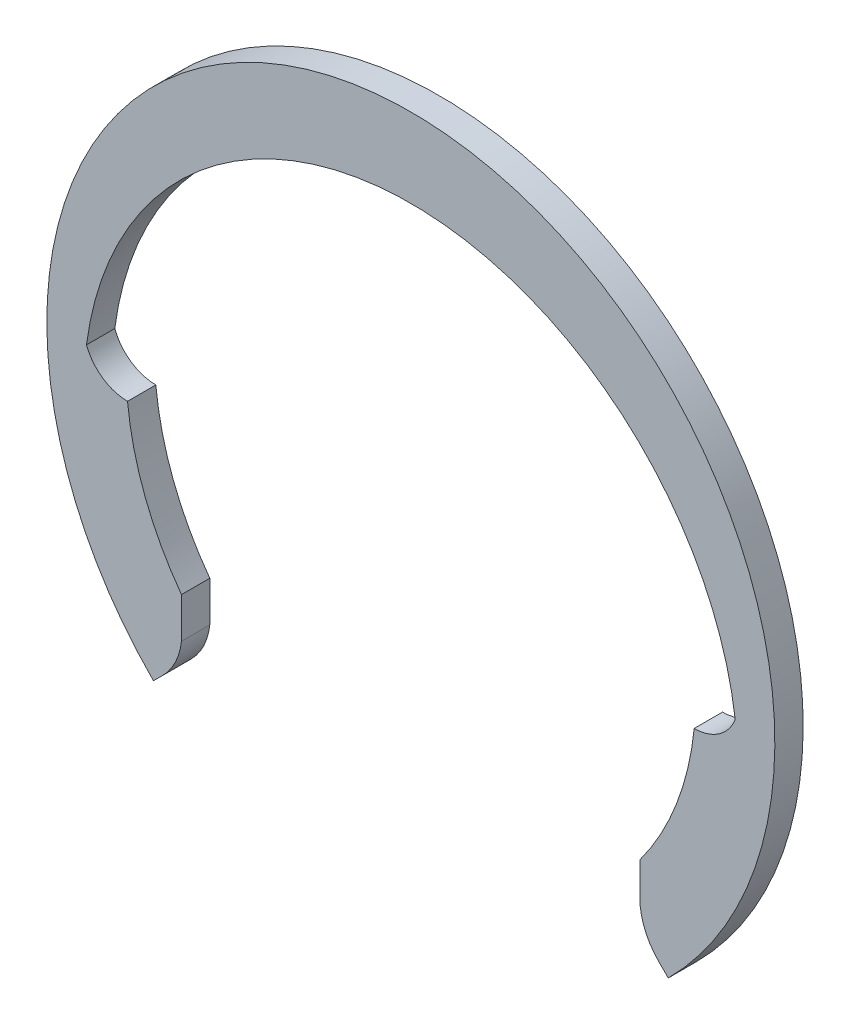
ISO-10303-21;
HEADER;
FILE_DESCRIPTION(('STEP AP214'),'2;1');
FILE_NAME('part.step','',(''),(''),'','','');
FILE_SCHEMA(('AUTOMOTIVE_DESIGN { 1 0 10303 214 1 1 1 1 }'));
ENDSEC;
DATA;
#1=APPLICATION_CONTEXT('core data for automotive mechanical design processes');
#2=APPLICATION_PROTOCOL_DEFINITION('international standard','automotive_design',2000,#1);
#3=PRODUCT_CONTEXT('',#1,'mechanical');
#4=PRODUCT('Part','Part','',(#3));
#5=PRODUCT_RELATED_PRODUCT_CATEGORY('part','',(#4));
#6=PRODUCT_DEFINITION_FORMATION('','',#4);
#7=PRODUCT_DEFINITION_CONTEXT('part definition',#1,'design');
#8=PRODUCT_DEFINITION('design','',#6,#7);
#9=PRODUCT_DEFINITION_SHAPE('','',#8);
#10=(LENGTH_UNIT() NAMED_UNIT(*) SI_UNIT(.MILLI.,.METRE.));
#11=(NAMED_UNIT(*) PLANE_ANGLE_UNIT() SI_UNIT($,.RADIAN.));
#12=(NAMED_UNIT(*) SI_UNIT($,.STERADIAN.) SOLID_ANGLE_UNIT());
#13=UNCERTAINTY_MEASURE_WITH_UNIT(LENGTH_MEASURE(1.E-05),#10,'distance_accuracy_value','');
#14=(GEOMETRIC_REPRESENTATION_CONTEXT(3) GLOBAL_UNCERTAINTY_ASSIGNED_CONTEXT((#13)) GLOBAL_UNIT_ASSIGNED_CONTEXT((#10,
#11,#12)) REPRESENTATION_CONTEXT('',''));
#15=CARTESIAN_POINT('',(0.,0.,0.));
#16=DIRECTION('',(0.,0.,1.));
#17=DIRECTION('',(1.,0.,0.));
#18=AXIS2_PLACEMENT_3D('',#15,#16,#17);
#19=CARTESIAN_POINT('',(-17.5127810469954,0.964280004424556,1.75));
#20=DIRECTION('',(0.,0.,-1.));
#21=DIRECTION('',(-1.,0.,0.));
#22=AXIS2_PLACEMENT_3D('',#19,#20,#21);
#23=CYLINDRICAL_SURFACE('',#22,2.71428000442456);
#24=CARTESIAN_POINT('',(-17.5127810469954,0.964280004424556,0.));
#25=DIRECTION('',(0.,0.,-1.));
#26=DIRECTION('',(1.,0.,0.));
#27=AXIS2_PLACEMENT_3D('',#24,#25,#26);
#28=CIRCLE('',#27,2.71428000442456);
#29=CARTESIAN_POINT('',(-17.5127810469954,-1.75,0.));
#30=VERTEX_POINT('',#29);
#31=CARTESIAN_POINT('',(-20.05,0.,0.));
#32=VERTEX_POINT('',#31);
#33=EDGE_CURVE('E154',#30,#32,#28,.T.);
#34=ORIENTED_EDGE('',*,*,#33,.T.);
#35=DIRECTION('',(0.,0.,-1.));
#36=VECTOR('',#35,1.);
#37=CARTESIAN_POINT('',(-20.05,0.,1.75));
#38=LINE('',#37,#36);
#39=CARTESIAN_POINT('',(-20.05,0.,1.75));
#40=VERTEX_POINT('',#39);
#41=EDGE_CURVE('E11',#40,#32,#38,.T.);
#42=ORIENTED_EDGE('',*,*,#41,.F.);
#43=CARTESIAN_POINT('',(-17.5127810469954,0.964280004424556,1.75));
#44=DIRECTION('',(0.,0.,-1.));
#45=DIRECTION('',(1.,0.,0.));
#46=AXIS2_PLACEMENT_3D('',#43,#44,#45);
#47=CIRCLE('',#46,2.71428000442456);
#48=CARTESIAN_POINT('',(-17.5127810469954,-1.75,1.75));
#49=VERTEX_POINT('',#48);
#50=EDGE_CURVE('E177',#49,#40,#47,.T.);
#51=ORIENTED_EDGE('',*,*,#50,.F.);
#52=DIRECTION('',(0.,0.,-1.));
#53=VECTOR('',#52,1.);
#54=CARTESIAN_POINT('',(-17.5127810469954,-1.75,1.75));
#55=LINE('',#54,#53);
#56=EDGE_CURVE('E150',#49,#30,#55,.T.);
#57=ORIENTED_EDGE('',*,*,#56,.T.);
#58=EDGE_LOOP('',(#34,#42,#51,#57));
#59=FACE_BOUND('',#58,.T.);
#60=ADVANCED_FACE('F34',(#59),#23,.F.);
#61=CARTESIAN_POINT('',(0.,-2.62052556818182,1.75));
#62=DIRECTION('',(0.,0.,-1.));
#63=DIRECTION('',(-1.,0.,0.));
#64=AXIS2_PLACEMENT_3D('',#61,#62,#63);
#65=CYLINDRICAL_SURFACE('',#64,20.2205255681818);
#66=CARTESIAN_POINT('',(0.,-2.62052556818182,0.));
#67=DIRECTION('',(0.,0.,-1.));
#68=DIRECTION('',(1.,0.,0.));
#69=AXIS2_PLACEMENT_3D('',#66,#67,#68);
#70=CIRCLE('',#69,20.2205255681818);
#71=CARTESIAN_POINT('',(20.05,0.,0.));
#72=VERTEX_POINT('',#71);
#73=EDGE_CURVE('E157',#32,#72,#70,.T.);
#74=ORIENTED_EDGE('',*,*,#73,.T.);
#75=DIRECTION('',(0.,0.,-1.));
#76=VECTOR('',#75,1.);
#77=CARTESIAN_POINT('',(20.05,0.,1.75));
#78=LINE('',#77,#76);
#79=CARTESIAN_POINT('',(20.05,0.,1.75));
#80=VERTEX_POINT('',#79);
#81=EDGE_CURVE('E42',#80,#72,#78,.T.);
#82=ORIENTED_EDGE('',*,*,#81,.F.);
#83=CARTESIAN_POINT('',(0.,-2.62052556818182,1.75));
#84=DIRECTION('',(0.,0.,-1.));
#85=DIRECTION('',(1.,0.,0.));
#86=AXIS2_PLACEMENT_3D('',#83,#84,#85);
#87=CIRCLE('',#86,20.2205255681818);
#88=EDGE_CURVE('E104',#40,#80,#87,.T.);
#89=ORIENTED_EDGE('',*,*,#88,.F.);
#90=ORIENTED_EDGE('',*,*,#41,.T.);
#91=EDGE_LOOP('',(#74,#82,#89,#90));
#92=FACE_BOUND('',#91,.T.);
#93=ADVANCED_FACE('F254',(#92),#65,.F.);
#94=CARTESIAN_POINT('',(17.5127810469954,0.964280004424561,1.75));
#95=DIRECTION('',(0.,0.,-1.));
#96=DIRECTION('',(-1.,0.,0.));
#97=AXIS2_PLACEMENT_3D('',#94,#95,#96);
#98=CYLINDRICAL_SURFACE('',#97,2.71428000442456);
#99=CARTESIAN_POINT('',(17.5127810469954,0.964280004424561,0.));
#100=DIRECTION('',(0.,0.,-1.));
#101=DIRECTION('',(-1.,0.,0.));
#102=AXIS2_PLACEMENT_3D('',#99,#100,#101);
#103=CIRCLE('',#102,2.71428000442456);
#104=CARTESIAN_POINT('',(17.5127810469954,-1.75,0.));
#105=VERTEX_POINT('',#104);
#106=EDGE_CURVE('E159',#72,#105,#103,.T.);
#107=ORIENTED_EDGE('',*,*,#106,.T.);
#108=DIRECTION('',(0.,0.,-1.));
#109=VECTOR('',#108,1.);
#110=CARTESIAN_POINT('',(17.5127810469954,-1.75,1.75));
#111=LINE('',#110,#109);
#112=CARTESIAN_POINT('',(17.5127810469954,-1.75,1.75));
#113=VERTEX_POINT('',#112);
#114=EDGE_CURVE('E196',#113,#105,#111,.T.);
#115=ORIENTED_EDGE('',*,*,#114,.F.);
#116=CARTESIAN_POINT('',(17.5127810469954,0.964280004424561,1.75));
#117=DIRECTION('',(0.,0.,-1.));
#118=DIRECTION('',(-1.,0.,0.));
#119=AXIS2_PLACEMENT_3D('',#116,#117,#118);
#120=CIRCLE('',#119,2.71428000442456);
#121=EDGE_CURVE('E204',#80,#113,#120,.T.);
#122=ORIENTED_EDGE('',*,*,#121,.F.);
#123=ORIENTED_EDGE('',*,*,#81,.T.);
#124=EDGE_LOOP('',(#107,#115,#122,#123));
#125=FACE_BOUND('',#124,.T.);
#126=ADVANCED_FACE('F202',(#125),#98,.F.);
#127=CARTESIAN_POINT('',(0.,0.,1.75));
#128=DIRECTION('',(0.,0.,-1.));
#129=DIRECTION('',(-1.,0.,0.));
#130=AXIS2_PLACEMENT_3D('',#127,#128,#129);
#131=CYLINDRICAL_SURFACE('',#130,17.6);
#132=CARTESIAN_POINT('',(0.,0.,0.));
#133=DIRECTION('',(0.,0.,-1.));
#134=DIRECTION('',(-1.,0.,0.));
#135=AXIS2_PLACEMENT_3D('',#132,#133,#134);
#136=CIRCLE('',#135,17.6);
#137=CARTESIAN_POINT('',(14.1774909627903,-10.4287463292574,0.));
#138=VERTEX_POINT('',#137);
#139=EDGE_CURVE('E161',#105,#138,#136,.T.);
#140=ORIENTED_EDGE('',*,*,#139,.T.);
#141=DIRECTION('',(0.,0.,-1.));
#142=VECTOR('',#141,1.);
#143=CARTESIAN_POINT('',(14.1774909627903,-10.4287463292574,1.75));
#144=LINE('',#143,#142);
#145=CARTESIAN_POINT('',(14.1774909627903,-10.4287463292574,1.75));
#146=VERTEX_POINT('',#145);
#147=EDGE_CURVE('E193',#146,#138,#144,.T.);
#148=ORIENTED_EDGE('',*,*,#147,.F.);
#149=CARTESIAN_POINT('',(0.,0.,1.75));
#150=DIRECTION('',(0.,0.,-1.));
#151=DIRECTION('',(-1.,0.,0.));
#152=AXIS2_PLACEMENT_3D('',#149,#150,#151);
#153=CIRCLE('',#152,17.6);
#154=EDGE_CURVE('E221',#113,#146,#153,.T.);
#155=ORIENTED_EDGE('',*,*,#154,.F.);
#156=ORIENTED_EDGE('',*,*,#114,.T.);
#157=EDGE_LOOP('',(#140,#148,#155,#156));
#158=FACE_BOUND('',#157,.T.);
#159=ADVANCED_FACE('F212',(#158),#131,.F.);
#160=CARTESIAN_POINT('',(14.1774909627903,-12.9279094182793,1.75));
#161=DIRECTION('',(1.,0.,0.));
#162=DIRECTION('',(0.,1.,0.));
#163=AXIS2_PLACEMENT_3D('',#160,#161,#162);
#164=PLANE('',#163);
#165=DIRECTION('',(0.,-1.,0.));
#166=VECTOR('',#165,1.);
#167=CARTESIAN_POINT('',(14.1774909627903,-12.9279094182793,0.));
#168=LINE('',#167,#166);
#169=CARTESIAN_POINT('',(14.1774909627903,-12.9279094182793,0.));
#170=VERTEX_POINT('',#169);
#171=EDGE_CURVE('E164',#138,#170,#168,.T.);
#172=ORIENTED_EDGE('',*,*,#171,.T.);
#173=DIRECTION('',(0.,0.,-1.));
#174=VECTOR('',#173,1.);
#175=CARTESIAN_POINT('',(14.1774909627903,-12.9279094182793,1.75));
#176=LINE('',#175,#174);
#177=CARTESIAN_POINT('',(14.1774909627903,-12.9279094182793,1.75));
#178=VERTEX_POINT('',#177);
#179=EDGE_CURVE('E190',#178,#170,#176,.T.);
#180=ORIENTED_EDGE('',*,*,#179,.F.);
#181=DIRECTION('',(0.,-1.,0.));
#182=VECTOR('',#181,1.);
#183=CARTESIAN_POINT('',(14.1774909627903,-11.6783278737683,1.75));
#184=LINE('',#183,#182);
#185=EDGE_CURVE('E218',#146,#178,#184,.T.);
#186=ORIENTED_EDGE('',*,*,#185,.F.);
#187=ORIENTED_EDGE('',*,*,#147,.T.);
#188=EDGE_LOOP('',(#172,#180,#186,#187));
#189=FACE_BOUND('',#188,.T.);
#190=ADVANCED_FACE('F216',(#189),#164,.F.);
#191=CARTESIAN_POINT('',(18.1796323484626,-12.485231728994,1.75));
#192=DIRECTION('',(0.,0.,-1.));
#193=DIRECTION('',(-1.,0.,0.));
#194=AXIS2_PLACEMENT_3D('',#191,#192,#193);
#195=CYLINDRICAL_SURFACE('',#194,4.02654929281911);
#196=CARTESIAN_POINT('',(18.1796323484626,-12.485231728994,0.));
#197=DIRECTION('',(0.,0.,1.));
#198=DIRECTION('',(1.,0.,0.));
#199=AXIS2_PLACEMENT_3D('',#196,#197,#198);
#200=CIRCLE('',#199,4.02654929281911);
#201=CARTESIAN_POINT('',(15.3324320387283,-15.3324320387283,0.));
#202=VERTEX_POINT('',#201);
#203=EDGE_CURVE('E166',#170,#202,#200,.T.);
#204=ORIENTED_EDGE('',*,*,#203,.T.);
#205=DIRECTION('',(0.,0.,-1.));
#206=VECTOR('',#205,1.);
#207=CARTESIAN_POINT('',(15.3324320387283,-15.3324320387283,1.75));
#208=LINE('',#207,#206);
#209=CARTESIAN_POINT('',(15.3324320387283,-15.3324320387283,1.75));
#210=VERTEX_POINT('',#209);
#211=EDGE_CURVE('E187',#210,#202,#208,.T.);
#212=ORIENTED_EDGE('',*,*,#211,.F.);
#213=CARTESIAN_POINT('',(18.1796323484626,-12.485231728994,1.75));
#214=DIRECTION('',(0.,0.,1.));
#215=DIRECTION('',(1.,0.,0.));
#216=AXIS2_PLACEMENT_3D('',#213,#214,#215);
#217=CIRCLE('',#216,4.02654929281911);
#218=EDGE_CURVE('E220',#178,#210,#217,.T.);
#219=ORIENTED_EDGE('',*,*,#218,.F.);
#220=ORIENTED_EDGE('',*,*,#179,.T.);
#221=EDGE_LOOP('',(#204,#212,#219,#220));
#222=FACE_BOUND('',#221,.T.);
#223=ADVANCED_FACE('F267',(#222),#195,.T.);
#224=CARTESIAN_POINT('',(15.3324320387283,-15.3324320387283,1.75));
#225=DIRECTION('',(0.707106781186552,0.707106781186543,0.));
#226=DIRECTION('',(-0.707106781186543,0.707106781186552,0.));
#227=AXIS2_PLACEMENT_3D('',#224,#225,#226);
#228=PLANE('',#227);
#229=DIRECTION('',(0.707106781186543,-0.707106781186552,0.));
#230=VECTOR('',#229,1.);
#231=CARTESIAN_POINT('',(15.3324320387283,-15.3324320387283,0.));
#232=LINE('',#231,#230);
#233=CARTESIAN_POINT('',(15.9099025766973,-15.9099025766973,0.));
#234=VERTEX_POINT('',#233);
#235=EDGE_CURVE('E168',#202,#234,#232,.T.);
#236=ORIENTED_EDGE('',*,*,#235,.T.);
#237=DIRECTION('',(0.,0.,-1.));
#238=VECTOR('',#237,1.);
#239=CARTESIAN_POINT('',(15.9099025766973,-15.9099025766973,1.75));
#240=LINE('',#239,#238);
#241=CARTESIAN_POINT('',(15.9099025766973,-15.9099025766973,1.75));
#242=VERTEX_POINT('',#241);
#243=EDGE_CURVE('E184',#242,#234,#240,.T.);
#244=ORIENTED_EDGE('',*,*,#243,.F.);
#245=DIRECTION('',(0.707106781186543,-0.707106781186552,0.));
#246=VECTOR('',#245,1.);
#247=CARTESIAN_POINT('',(15.3324320387283,-15.3324320387283,1.75));
#248=LINE('',#247,#246);
#249=EDGE_CURVE('E223',#210,#242,#248,.T.);
#250=ORIENTED_EDGE('',*,*,#249,.F.);
#251=ORIENTED_EDGE('',*,*,#211,.T.);
#252=EDGE_LOOP('',(#236,#244,#250,#251));
#253=FACE_BOUND('',#252,.T.);
#254=ADVANCED_FACE('F270',(#253),#228,.F.);
#255=CARTESIAN_POINT('',(0.,0.,1.75));
#256=DIRECTION('',(0.,0.,-1.));
#257=DIRECTION('',(-1.,0.,0.));
#258=AXIS2_PLACEMENT_3D('',#255,#256,#257);
#259=CYLINDRICAL_SURFACE('',#258,22.5);
#260=CARTESIAN_POINT('',(0.,0.,0.));
#261=DIRECTION('',(0.,0.,1.));
#262=DIRECTION('',(1.,0.,0.));
#263=AXIS2_PLACEMENT_3D('',#260,#261,#262);
#264=CIRCLE('',#263,22.5);
#265=CARTESIAN_POINT('',(-15.9099025766973,-15.9099025766973,0.));
#266=VERTEX_POINT('',#265);
#267=EDGE_CURVE('E170',#234,#266,#264,.T.);
#268=ORIENTED_EDGE('',*,*,#267,.T.);
#269=DIRECTION('',(0.,0.,-1.));
#270=VECTOR('',#269,1.);
#271=CARTESIAN_POINT('',(-15.9099025766973,-15.9099025766973,1.75));
#272=LINE('',#271,#270);
#273=CARTESIAN_POINT('',(-15.9099025766973,-15.9099025766973,1.75));
#274=VERTEX_POINT('',#273);
#275=EDGE_CURVE('E181',#274,#266,#272,.T.);
#276=ORIENTED_EDGE('',*,*,#275,.F.);
#277=CARTESIAN_POINT('',(0.,0.,1.75));
#278=DIRECTION('',(0.,0.,1.));
#279=DIRECTION('',(1.,0.,0.));
#280=AXIS2_PLACEMENT_3D('',#277,#278,#279);
#281=CIRCLE('',#280,22.5);
#282=EDGE_CURVE('E229',#242,#274,#281,.T.);
#283=ORIENTED_EDGE('',*,*,#282,.F.);
#284=ORIENTED_EDGE('',*,*,#243,.T.);
#285=EDGE_LOOP('',(#268,#276,#283,#284));
#286=FACE_BOUND('',#285,.T.);
#287=ADVANCED_FACE('F235',(#286),#259,.T.);
#288=CARTESIAN_POINT('',(-15.3324320387283,-15.3324320387283,1.75));
#289=DIRECTION('',(-0.70710678118655,0.707106781186545,0.));
#290=DIRECTION('',(-0.707106781186545,-0.70710678118655,0.));
#291=AXIS2_PLACEMENT_3D('',#288,#289,#290);
#292=PLANE('',#291);
#293=DIRECTION('',(0.707106781186545,0.70710678118655,0.));
#294=VECTOR('',#293,1.);
#295=CARTESIAN_POINT('',(-15.3324320387283,-15.3324320387283,0.));
#296=LINE('',#295,#294);
#297=CARTESIAN_POINT('',(-15.3324320387283,-15.3324320387283,0.));
#298=VERTEX_POINT('',#297);
#299=EDGE_CURVE('E172',#266,#298,#296,.T.);
#300=ORIENTED_EDGE('',*,*,#299,.T.);
#301=DIRECTION('',(0.,0.,-1.));
#302=VECTOR('',#301,1.);
#303=CARTESIAN_POINT('',(-15.3324320387283,-15.3324320387283,1.75));
#304=LINE('',#303,#302);
#305=CARTESIAN_POINT('',(-15.3324320387283,-15.3324320387283,1.75));
#306=VERTEX_POINT('',#305);
#307=EDGE_CURVE('E145',#306,#298,#304,.T.);
#308=ORIENTED_EDGE('',*,*,#307,.F.);
#309=DIRECTION('',(0.707106781186545,0.70710678118655,0.));
#310=VECTOR('',#309,1.);
#311=CARTESIAN_POINT('',(-15.3324320387283,-15.3324320387283,1.75));
#312=LINE('',#311,#310);
#313=EDGE_CURVE('E135',#274,#306,#312,.T.);
#314=ORIENTED_EDGE('',*,*,#313,.F.);
#315=ORIENTED_EDGE('',*,*,#275,.T.);
#316=EDGE_LOOP('',(#300,#308,#314,#315));
#317=FACE_BOUND('',#316,.T.);
#318=ADVANCED_FACE('F239',(#317),#292,.F.);
#319=CARTESIAN_POINT('',(-18.1796323484626,-12.485231728994,1.75));
#320=DIRECTION('',(0.,0.,-1.));
#321=DIRECTION('',(-1.,0.,0.));
#322=AXIS2_PLACEMENT_3D('',#319,#320,#321);
#323=CYLINDRICAL_SURFACE('',#322,4.02654929281912);
#324=CARTESIAN_POINT('',(-18.1796323484626,-12.485231728994,0.));
#325=DIRECTION('',(0.,0.,1.));
#326=DIRECTION('',(-1.,0.,0.));
#327=AXIS2_PLACEMENT_3D('',#324,#325,#326);
#328=CIRCLE('',#327,4.02654929281912);
#329=CARTESIAN_POINT('',(-14.1774909627903,-12.9279094182793,0.));
#330=VERTEX_POINT('',#329);
#331=EDGE_CURVE('E144',#298,#330,#328,.T.);
#332=ORIENTED_EDGE('',*,*,#331,.T.);
#333=DIRECTION('',(0.,0.,-1.));
#334=VECTOR('',#333,1.);
#335=CARTESIAN_POINT('',(-14.1774909627903,-12.9279094182793,1.75));
#336=LINE('',#335,#334);
#337=CARTESIAN_POINT('',(-14.1774909627903,-12.9279094182793,1.75));
#338=VERTEX_POINT('',#337);
#339=EDGE_CURVE('E141',#338,#330,#336,.T.);
#340=ORIENTED_EDGE('',*,*,#339,.F.);
#341=CARTESIAN_POINT('',(-18.1796323484626,-12.485231728994,1.75));
#342=DIRECTION('',(0.,0.,1.));
#343=DIRECTION('',(-1.,0.,0.));
#344=AXIS2_PLACEMENT_3D('',#341,#342,#343);
#345=CIRCLE('',#344,4.02654929281912);
#346=EDGE_CURVE('E129',#306,#338,#345,.T.);
#347=ORIENTED_EDGE('',*,*,#346,.F.);
#348=ORIENTED_EDGE('',*,*,#307,.T.);
#349=EDGE_LOOP('',(#332,#340,#347,#348));
#350=FACE_BOUND('',#349,.T.);
#351=ADVANCED_FACE('F142',(#350),#323,.T.);
#352=CARTESIAN_POINT('',(-14.1774909627903,-11.6783278737683,1.75));
#353=DIRECTION('',(-1.,0.,0.));
#354=DIRECTION('',(0.,0.,1.));
#355=AXIS2_PLACEMENT_3D('',#352,#353,#354);
#356=PLANE('',#355);
#357=DIRECTION('',(0.,1.,0.));
#358=VECTOR('',#357,1.);
#359=CARTESIAN_POINT('',(-14.1774909627903,-11.6783278737683,0.));
#360=LINE('',#359,#358);
#361=CARTESIAN_POINT('',(-14.1774909627903,-10.4287463292574,0.));
#362=VERTEX_POINT('',#361);
#363=EDGE_CURVE('E90',#330,#362,#360,.T.);
#364=ORIENTED_EDGE('',*,*,#363,.T.);
#365=DIRECTION('',(0.,0.,-1.));
#366=VECTOR('',#365,1.);
#367=CARTESIAN_POINT('',(-14.1774909627903,-10.4287463292574,1.75));
#368=LINE('',#367,#366);
#369=CARTESIAN_POINT('',(-14.1774909627903,-10.4287463292574,1.75));
#370=VERTEX_POINT('',#369);
#371=EDGE_CURVE('E146',#370,#362,#368,.T.);
#372=ORIENTED_EDGE('',*,*,#371,.F.);
#373=DIRECTION('',(0.,1.,0.));
#374=VECTOR('',#373,1.);
#375=CARTESIAN_POINT('',(-14.1774909627903,-12.9279094182793,1.75));
#376=LINE('',#375,#374);
#377=EDGE_CURVE('E133',#338,#370,#376,.T.);
#378=ORIENTED_EDGE('',*,*,#377,.F.);
#379=ORIENTED_EDGE('',*,*,#339,.T.);
#380=EDGE_LOOP('',(#364,#372,#378,#379));
#381=FACE_BOUND('',#380,.T.);
#382=ADVANCED_FACE('F148',(#381),#356,.F.);
#383=CARTESIAN_POINT('',(0.,0.,1.75));
#384=DIRECTION('',(0.,0.,-1.));
#385=DIRECTION('',(-1.,0.,0.));
#386=AXIS2_PLACEMENT_3D('',#383,#384,#385);
#387=CYLINDRICAL_SURFACE('',#386,17.6);
#388=CARTESIAN_POINT('',(0.,0.,0.));
#389=DIRECTION('',(0.,0.,-1.));
#390=DIRECTION('',(1.,0.,0.));
#391=AXIS2_PLACEMENT_3D('',#388,#389,#390);
#392=CIRCLE('',#391,17.6);
#393=EDGE_CURVE('E96',#362,#30,#392,.T.);
#394=ORIENTED_EDGE('',*,*,#393,.T.);
#395=ORIENTED_EDGE('',*,*,#56,.F.);
#396=CARTESIAN_POINT('',(0.,0.,1.75));
#397=DIRECTION('',(0.,0.,-1.));
#398=DIRECTION('',(1.,0.,0.));
#399=AXIS2_PLACEMENT_3D('',#396,#397,#398);
#400=CIRCLE('',#399,17.6);
#401=EDGE_CURVE('E50',#370,#49,#400,.T.);
#402=ORIENTED_EDGE('',*,*,#401,.F.);
#403=ORIENTED_EDGE('',*,*,#371,.T.);
#404=EDGE_LOOP('',(#394,#395,#402,#403));
#405=FACE_BOUND('',#404,.T.);
#406=ADVANCED_FACE('F243',(#405),#387,.F.);
#407=CARTESIAN_POINT('',(-17.5127810469954,0.964280004424556,1.75));
#408=DIRECTION('',(0.,0.,1.));
#409=DIRECTION('',(1.,0.,0.));
#410=AXIS2_PLACEMENT_3D('',#407,#408,#409);
#411=PLANE('',#410);
#412=ORIENTED_EDGE('',*,*,#50,.T.);
#413=ORIENTED_EDGE('',*,*,#88,.T.);
#414=ORIENTED_EDGE('',*,*,#121,.T.);
#415=ORIENTED_EDGE('',*,*,#154,.T.);
#416=ORIENTED_EDGE('',*,*,#185,.T.);
#417=ORIENTED_EDGE('',*,*,#218,.T.);
#418=ORIENTED_EDGE('',*,*,#249,.T.);
#419=ORIENTED_EDGE('',*,*,#282,.T.);
#420=ORIENTED_EDGE('',*,*,#313,.T.);
#421=ORIENTED_EDGE('',*,*,#346,.T.);
#422=ORIENTED_EDGE('',*,*,#377,.T.);
#423=ORIENTED_EDGE('',*,*,#401,.T.);
#424=EDGE_LOOP('',(#412,#413,#414,#415,#416,#417,#418,#419,#420,#421,#422,#423));
#425=FACE_BOUND('',#424,.T.);
#426=ADVANCED_FACE('F131',(#425),#411,.T.);
#427=CARTESIAN_POINT('',(-17.5127810469954,0.964280004424556,0.));
#428=DIRECTION('',(0.,0.,1.));
#429=DIRECTION('',(1.,0.,0.));
#430=AXIS2_PLACEMENT_3D('',#427,#428,#429);
#431=PLANE('',#430);
#432=ORIENTED_EDGE('',*,*,#33,.F.);
#433=ORIENTED_EDGE('',*,*,#393,.F.);
#434=ORIENTED_EDGE('',*,*,#363,.F.);
#435=ORIENTED_EDGE('',*,*,#331,.F.);
#436=ORIENTED_EDGE('',*,*,#299,.F.);
#437=ORIENTED_EDGE('',*,*,#267,.F.);
#438=ORIENTED_EDGE('',*,*,#235,.F.);
#439=ORIENTED_EDGE('',*,*,#203,.F.);
#440=ORIENTED_EDGE('',*,*,#171,.F.);
#441=ORIENTED_EDGE('',*,*,#139,.F.);
#442=ORIENTED_EDGE('',*,*,#106,.F.);
#443=ORIENTED_EDGE('',*,*,#73,.F.);
#444=EDGE_LOOP('',(#432,#433,#434,#435,#436,#437,#438,#439,#440,#441,#442,#443));
#445=FACE_BOUND('',#444,.T.);
#446=ADVANCED_FACE('F208',(#445),#431,.F.);
#447=CLOSED_SHELL('',(#60,#93,#126,#159,#190,#223,#254,#287,#318,#351,#382,#406,#426,#446));
#448=MANIFOLD_SOLID_BREP('B2',#447);
#449=ADVANCED_BREP_SHAPE_REPRESENTATION('',(#18,#448),#14);
#450=SHAPE_DEFINITION_REPRESENTATION(#9,#449);
ENDSEC;
END-ISO-10303-21;
